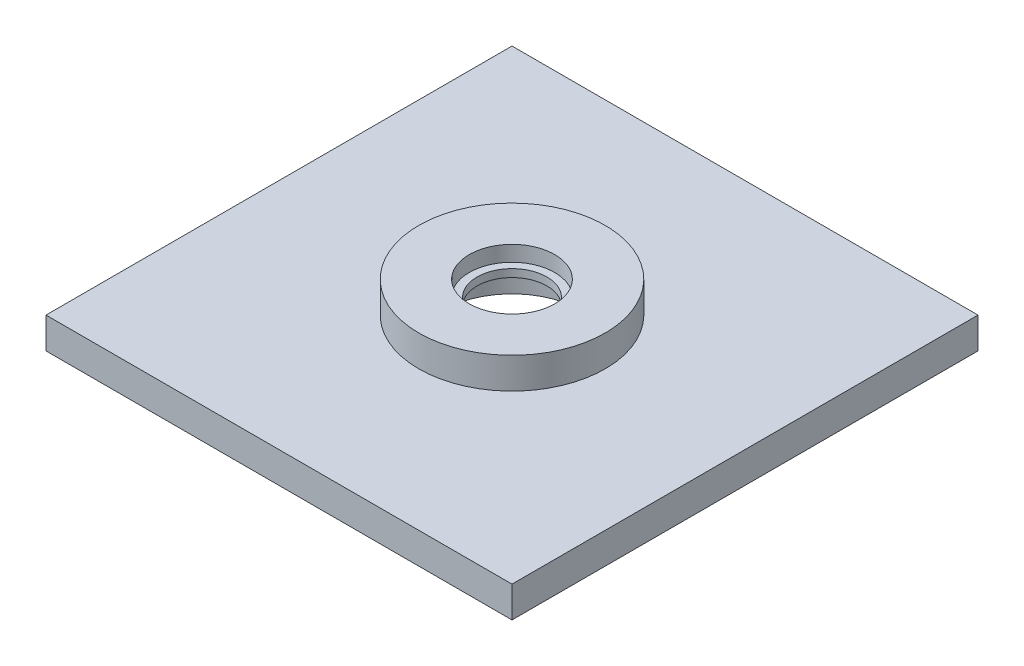
ISO-10303-21;
HEADER;
FILE_DESCRIPTION(('STEP AP214'),'2;1');
FILE_NAME('part.step','',(''),(''),'','','');
FILE_SCHEMA(('AUTOMOTIVE_DESIGN { 1 0 10303 214 1 1 1 1 }'));
ENDSEC;
DATA;
#1=APPLICATION_CONTEXT('core data for automotive mechanical design processes');
#2=APPLICATION_PROTOCOL_DEFINITION('international standard','automotive_design',2000,#1);
#3=PRODUCT_CONTEXT('',#1,'mechanical');
#4=PRODUCT('Part','Part','',(#3));
#5=PRODUCT_RELATED_PRODUCT_CATEGORY('part','',(#4));
#6=PRODUCT_DEFINITION_FORMATION('','',#4);
#7=PRODUCT_DEFINITION_CONTEXT('part definition',#1,'design');
#8=PRODUCT_DEFINITION('design','',#6,#7);
#9=PRODUCT_DEFINITION_SHAPE('','',#8);
#10=(LENGTH_UNIT() NAMED_UNIT(*) SI_UNIT(.MILLI.,.METRE.));
#11=(NAMED_UNIT(*) PLANE_ANGLE_UNIT() SI_UNIT($,.RADIAN.));
#12=(NAMED_UNIT(*) SI_UNIT($,.STERADIAN.) SOLID_ANGLE_UNIT());
#13=UNCERTAINTY_MEASURE_WITH_UNIT(LENGTH_MEASURE(1.E-05),#10,'distance_accuracy_value','');
#14=(GEOMETRIC_REPRESENTATION_CONTEXT(3) GLOBAL_UNCERTAINTY_ASSIGNED_CONTEXT((#13)) GLOBAL_UNIT_ASSIGNED_CONTEXT((#10,
#11,#12)) REPRESENTATION_CONTEXT('',''));
#15=CARTESIAN_POINT('',(0.,0.,0.));
#16=DIRECTION('',(0.,0.,1.));
#17=DIRECTION('',(1.,0.,0.));
#18=AXIS2_PLACEMENT_3D('',#15,#16,#17);
#19=CARTESIAN_POINT('',(0.,6.35,0.));
#20=DIRECTION('',(0.,-1.,0.));
#21=DIRECTION('',(0.,0.,-1.));
#22=AXIS2_PLACEMENT_3D('',#19,#20,#21);
#23=CYLINDRICAL_SURFACE('',#22,7.14375);
#24=CARTESIAN_POINT('',(0.,7.9375,0.));
#25=DIRECTION('',(0.,-1.,0.));
#26=DIRECTION('',(0.,0.,-1.));
#27=AXIS2_PLACEMENT_3D('',#24,#25,#26);
#28=CIRCLE('',#27,7.14375);
#29=CARTESIAN_POINT('',(0.,7.9375,-7.14375000000001));
#30=VERTEX_POINT('',#29);
#31=EDGE_CURVE('E109',#30,#30,#28,.T.);
#32=ORIENTED_EDGE('',*,*,#31,.T.);
#33=EDGE_LOOP('',(#32));
#34=FACE_BOUND('',#33,.T.);
#35=CARTESIAN_POINT('',(0.,9.525,0.));
#36=DIRECTION('',(0.,1.,0.));
#37=DIRECTION('',(0.,0.,1.));
#38=AXIS2_PLACEMENT_3D('',#35,#36,#37);
#39=CIRCLE('',#38,7.14375);
#40=CARTESIAN_POINT('',(0.,9.525,7.14374999999999));
#41=VERTEX_POINT('',#40);
#42=EDGE_CURVE('E37',#41,#41,#39,.T.);
#43=ORIENTED_EDGE('',*,*,#42,.T.);
#44=EDGE_LOOP('',(#43));
#45=FACE_BOUND('',#44,.T.);
#46=ADVANCED_FACE('F33',(#34,#45),#23,.F.);
#47=CARTESIAN_POINT('',(0.,6.35,0.));
#48=DIRECTION('',(0.,1.,0.));
#49=DIRECTION('',(0.,0.,1.));
#50=AXIS2_PLACEMENT_3D('',#47,#48,#49);
#51=PLANE('',#50);
#52=DIRECTION('',(0.,0.,-1.));
#53=VECTOR('',#52,1.);
#54=CARTESIAN_POINT('',(47.625,6.35,-47.625));
#55=LINE('',#54,#53);
#56=CARTESIAN_POINT('',(47.625,6.35,47.625));
#57=VERTEX_POINT('',#56);
#58=CARTESIAN_POINT('',(47.625,6.35,-47.625));
#59=VERTEX_POINT('',#58);
#60=EDGE_CURVE('E88',#57,#59,#55,.T.);
#61=ORIENTED_EDGE('',*,*,#60,.T.);
#62=DIRECTION('',(-1.,0.,0.));
#63=VECTOR('',#62,1.);
#64=CARTESIAN_POINT('',(-47.625,6.35,-47.625));
#65=LINE('',#64,#63);
#66=CARTESIAN_POINT('',(-47.625,6.35,-47.625));
#67=VERTEX_POINT('',#66);
#68=EDGE_CURVE('E82',#59,#67,#65,.T.);
#69=ORIENTED_EDGE('',*,*,#68,.T.);
#70=DIRECTION('',(0.,0.,1.));
#71=VECTOR('',#70,1.);
#72=CARTESIAN_POINT('',(-47.625,6.35,-47.625));
#73=LINE('',#72,#71);
#74=CARTESIAN_POINT('',(-47.625,6.35,47.625));
#75=VERTEX_POINT('',#74);
#76=EDGE_CURVE('E86',#67,#75,#73,.T.);
#77=ORIENTED_EDGE('',*,*,#76,.T.);
#78=DIRECTION('',(1.,0.,0.));
#79=VECTOR('',#78,1.);
#80=CARTESIAN_POINT('',(-47.625,6.35,47.625));
#81=LINE('',#80,#79);
#82=EDGE_CURVE('E52',#75,#57,#81,.T.);
#83=ORIENTED_EDGE('',*,*,#82,.T.);
#84=EDGE_LOOP('',(#61,#69,#77,#83));
#85=FACE_BOUND('',#84,.T.);
#86=CARTESIAN_POINT('',(0.,6.35,0.));
#87=DIRECTION('',(0.,1.,0.));
#88=DIRECTION('',(0.,0.,1.));
#89=AXIS2_PLACEMENT_3D('',#86,#87,#88);
#90=CIRCLE('',#89,19.05);
#91=CARTESIAN_POINT('',(0.,6.35,19.05));
#92=VERTEX_POINT('',#91);
#93=EDGE_CURVE('E111',#92,#92,#90,.T.);
#94=ORIENTED_EDGE('',*,*,#93,.F.);
#95=EDGE_LOOP('',(#94));
#96=FACE_BOUND('',#95,.T.);
#97=ADVANCED_FACE('F83',(#85,#96),#51,.T.);
#98=CARTESIAN_POINT('',(0.,0.,0.));
#99=DIRECTION('',(0.,1.,0.));
#100=DIRECTION('',(0.,0.,1.));
#101=AXIS2_PLACEMENT_3D('',#98,#99,#100);
#102=PLANE('',#101);
#103=CARTESIAN_POINT('',(0.,0.,0.));
#104=DIRECTION('',(0.,-1.,0.));
#105=DIRECTION('',(0.,0.,-1.));
#106=AXIS2_PLACEMENT_3D('',#103,#104,#105);
#107=CIRCLE('',#106,14.2875);
#108=CARTESIAN_POINT('',(0.,0.,-14.2875));
#109=VERTEX_POINT('',#108);
#110=EDGE_CURVE('E118',#109,#109,#107,.T.);
#111=ORIENTED_EDGE('',*,*,#110,.F.);
#112=EDGE_LOOP('',(#111));
#113=FACE_BOUND('',#112,.T.);
#114=DIRECTION('',(0.,0.,-1.));
#115=VECTOR('',#114,1.);
#116=CARTESIAN_POINT('',(47.625,0.,-47.625));
#117=LINE('',#116,#115);
#118=CARTESIAN_POINT('',(47.625,0.,47.625));
#119=VERTEX_POINT('',#118);
#120=CARTESIAN_POINT('',(47.625,0.,-47.625));
#121=VERTEX_POINT('',#120);
#122=EDGE_CURVE('E101',#119,#121,#117,.T.);
#123=ORIENTED_EDGE('',*,*,#122,.F.);
#124=DIRECTION('',(1.,0.,0.));
#125=VECTOR('',#124,1.);
#126=CARTESIAN_POINT('',(-47.625,0.,47.625));
#127=LINE('',#126,#125);
#128=CARTESIAN_POINT('',(-47.625,0.,47.625));
#129=VERTEX_POINT('',#128);
#130=EDGE_CURVE('E75',#129,#119,#127,.T.);
#131=ORIENTED_EDGE('',*,*,#130,.F.);
#132=DIRECTION('',(0.,0.,1.));
#133=VECTOR('',#132,1.);
#134=CARTESIAN_POINT('',(-47.625,0.,-47.625));
#135=LINE('',#134,#133);
#136=CARTESIAN_POINT('',(-47.625,0.,-47.625));
#137=VERTEX_POINT('',#136);
#138=EDGE_CURVE('E69',#137,#129,#135,.T.);
#139=ORIENTED_EDGE('',*,*,#138,.F.);
#140=DIRECTION('',(-1.,0.,0.));
#141=VECTOR('',#140,1.);
#142=CARTESIAN_POINT('',(-47.625,0.,-47.625));
#143=LINE('',#142,#141);
#144=EDGE_CURVE('E92',#121,#137,#143,.T.);
#145=ORIENTED_EDGE('',*,*,#144,.F.);
#146=EDGE_LOOP('',(#123,#131,#139,#145));
#147=FACE_BOUND('',#146,.T.);
#148=ADVANCED_FACE('F140',(#113,#147),#102,.F.);
#149=CARTESIAN_POINT('',(47.625,6.35,-47.625));
#150=DIRECTION('',(-1.,0.,0.));
#151=DIRECTION('',(0.,0.,1.));
#152=AXIS2_PLACEMENT_3D('',#149,#150,#151);
#153=PLANE('',#152);
#154=ORIENTED_EDGE('',*,*,#122,.T.);
#155=DIRECTION('',(0.,-1.,0.));
#156=VECTOR('',#155,1.);
#157=CARTESIAN_POINT('',(47.625,6.35,-47.625));
#158=LINE('',#157,#156);
#159=EDGE_CURVE('E11',#59,#121,#158,.T.);
#160=ORIENTED_EDGE('',*,*,#159,.F.);
#161=ORIENTED_EDGE('',*,*,#60,.F.);
#162=DIRECTION('',(0.,-1.,0.));
#163=VECTOR('',#162,1.);
#164=CARTESIAN_POINT('',(47.625,6.35,47.625));
#165=LINE('',#164,#163);
#166=EDGE_CURVE('E97',#57,#119,#165,.T.);
#167=ORIENTED_EDGE('',*,*,#166,.T.);
#168=EDGE_LOOP('',(#154,#160,#161,#167));
#169=FACE_BOUND('',#168,.T.);
#170=ADVANCED_FACE('F35',(#169),#153,.F.);
#171=CARTESIAN_POINT('',(-47.625,6.35,-47.625));
#172=DIRECTION('',(0.,0.,1.));
#173=DIRECTION('',(1.,0.,0.));
#174=AXIS2_PLACEMENT_3D('',#171,#172,#173);
#175=PLANE('',#174);
#176=ORIENTED_EDGE('',*,*,#144,.T.);
#177=DIRECTION('',(0.,-1.,0.));
#178=VECTOR('',#177,1.);
#179=CARTESIAN_POINT('',(-47.625,6.35,-47.625));
#180=LINE('',#179,#178);
#181=EDGE_CURVE('E43',#67,#137,#180,.T.);
#182=ORIENTED_EDGE('',*,*,#181,.F.);
#183=ORIENTED_EDGE('',*,*,#68,.F.);
#184=ORIENTED_EDGE('',*,*,#159,.T.);
#185=EDGE_LOOP('',(#176,#182,#183,#184));
#186=FACE_BOUND('',#185,.T.);
#187=ADVANCED_FACE('F91',(#186),#175,.F.);
#188=CARTESIAN_POINT('',(-47.625,6.35,-47.625));
#189=DIRECTION('',(1.,0.,0.));
#190=DIRECTION('',(0.,0.,-1.));
#191=AXIS2_PLACEMENT_3D('',#188,#189,#190);
#192=PLANE('',#191);
#193=ORIENTED_EDGE('',*,*,#138,.T.);
#194=DIRECTION('',(0.,-1.,0.));
#195=VECTOR('',#194,1.);
#196=CARTESIAN_POINT('',(-47.625,6.35,47.625));
#197=LINE('',#196,#195);
#198=EDGE_CURVE('E93',#75,#129,#197,.T.);
#199=ORIENTED_EDGE('',*,*,#198,.F.);
#200=ORIENTED_EDGE('',*,*,#76,.F.);
#201=ORIENTED_EDGE('',*,*,#181,.T.);
#202=EDGE_LOOP('',(#193,#199,#200,#201));
#203=FACE_BOUND('',#202,.T.);
#204=ADVANCED_FACE('F95',(#203),#192,.F.);
#205=CARTESIAN_POINT('',(-47.625,6.35,47.625));
#206=DIRECTION('',(0.,0.,-1.));
#207=DIRECTION('',(-1.,0.,0.));
#208=AXIS2_PLACEMENT_3D('',#205,#206,#207);
#209=PLANE('',#208);
#210=ORIENTED_EDGE('',*,*,#130,.T.);
#211=ORIENTED_EDGE('',*,*,#166,.F.);
#212=ORIENTED_EDGE('',*,*,#82,.F.);
#213=ORIENTED_EDGE('',*,*,#198,.T.);
#214=EDGE_LOOP('',(#210,#211,#212,#213));
#215=FACE_BOUND('',#214,.T.);
#216=ADVANCED_FACE('F150',(#215),#209,.F.);
#217=CARTESIAN_POINT('',(0.,12.7,0.));
#218=DIRECTION('',(0.,1.,0.));
#219=DIRECTION('',(0.,0.,1.));
#220=AXIS2_PLACEMENT_3D('',#217,#218,#219);
#221=PLANE('',#220);
#222=CARTESIAN_POINT('',(0.,12.7,0.));
#223=DIRECTION('',(0.,1.,0.));
#224=DIRECTION('',(0.,0.,1.));
#225=AXIS2_PLACEMENT_3D('',#222,#223,#224);
#226=CIRCLE('',#225,8.73125);
#227=CARTESIAN_POINT('',(0.,12.7,8.73124999999999));
#228=VERTEX_POINT('',#227);
#229=EDGE_CURVE('E125',#228,#228,#226,.T.);
#230=ORIENTED_EDGE('',*,*,#229,.F.);
#231=EDGE_LOOP('',(#230));
#232=FACE_BOUND('',#231,.T.);
#233=CARTESIAN_POINT('',(0.,12.7,0.));
#234=DIRECTION('',(0.,1.,0.));
#235=DIRECTION('',(0.,0.,1.));
#236=AXIS2_PLACEMENT_3D('',#233,#234,#235);
#237=CIRCLE('',#236,19.05);
#238=CARTESIAN_POINT('',(0.,12.7,19.05));
#239=VERTEX_POINT('',#238);
#240=EDGE_CURVE('E104',#239,#239,#237,.T.);
#241=ORIENTED_EDGE('',*,*,#240,.T.);
#242=EDGE_LOOP('',(#241));
#243=FACE_BOUND('',#242,.T.);
#244=ADVANCED_FACE('F131',(#232,#243),#221,.T.);
#245=CARTESIAN_POINT('',(0.,12.7,0.));
#246=DIRECTION('',(0.,-1.,0.));
#247=DIRECTION('',(0.,0.,-1.));
#248=AXIS2_PLACEMENT_3D('',#245,#246,#247);
#249=CYLINDRICAL_SURFACE('',#248,19.05);
#250=ORIENTED_EDGE('',*,*,#240,.F.);
#251=EDGE_LOOP('',(#250));
#252=FACE_BOUND('',#251,.T.);
#253=ORIENTED_EDGE('',*,*,#93,.T.);
#254=EDGE_LOOP('',(#253));
#255=FACE_BOUND('',#254,.T.);
#256=ADVANCED_FACE('F133',(#252,#255),#249,.T.);
#257=CARTESIAN_POINT('',(0.,7.9375,0.));
#258=DIRECTION('',(0.,-1.,0.));
#259=DIRECTION('',(0.,0.,-1.));
#260=AXIS2_PLACEMENT_3D('',#257,#258,#259);
#261=CYLINDRICAL_SURFACE('',#260,14.2875);
#262=CARTESIAN_POINT('',(0.,7.9375,0.));
#263=DIRECTION('',(0.,-1.,0.));
#264=DIRECTION('',(0.,0.,-1.));
#265=AXIS2_PLACEMENT_3D('',#262,#263,#264);
#266=CIRCLE('',#265,14.2875);
#267=CARTESIAN_POINT('',(0.,7.9375,-14.2875));
#268=VERTEX_POINT('',#267);
#269=EDGE_CURVE('E112',#268,#268,#266,.T.);
#270=ORIENTED_EDGE('',*,*,#269,.F.);
#271=EDGE_LOOP('',(#270));
#272=FACE_BOUND('',#271,.T.);
#273=ORIENTED_EDGE('',*,*,#110,.T.);
#274=EDGE_LOOP('',(#273));
#275=FACE_BOUND('',#274,.T.);
#276=ADVANCED_FACE('F136',(#272,#275),#261,.F.);
#277=CARTESIAN_POINT('',(0.,7.9375,0.));
#278=DIRECTION('',(0.,-1.,0.));
#279=DIRECTION('',(0.,0.,-1.));
#280=AXIS2_PLACEMENT_3D('',#277,#278,#279);
#281=PLANE('',#280);
#282=ORIENTED_EDGE('',*,*,#31,.F.);
#283=EDGE_LOOP('',(#282));
#284=FACE_BOUND('',#283,.T.);
#285=ORIENTED_EDGE('',*,*,#269,.T.);
#286=EDGE_LOOP('',(#285));
#287=FACE_BOUND('',#286,.T.);
#288=ADVANCED_FACE('F179',(#284,#287),#281,.T.);
#289=CARTESIAN_POINT('',(0.,9.525,0.));
#290=DIRECTION('',(0.,1.,0.));
#291=DIRECTION('',(0.,0.,1.));
#292=AXIS2_PLACEMENT_3D('',#289,#290,#291);
#293=CYLINDRICAL_SURFACE('',#292,8.73125);
#294=CARTESIAN_POINT('',(0.,9.525,0.));
#295=DIRECTION('',(0.,1.,0.));
#296=DIRECTION('',(0.,0.,1.));
#297=AXIS2_PLACEMENT_3D('',#294,#295,#296);
#298=CIRCLE('',#297,8.73125);
#299=CARTESIAN_POINT('',(0.,9.525,8.73124999999999));
#300=VERTEX_POINT('',#299);
#301=EDGE_CURVE('E235',#300,#300,#298,.T.);
#302=ORIENTED_EDGE('',*,*,#301,.F.);
#303=EDGE_LOOP('',(#302));
#304=FACE_BOUND('',#303,.T.);
#305=ORIENTED_EDGE('',*,*,#229,.T.);
#306=EDGE_LOOP('',(#305));
#307=FACE_BOUND('',#306,.T.);
#308=ADVANCED_FACE('F189',(#304,#307),#293,.F.);
#309=CARTESIAN_POINT('',(0.,9.525,0.));
#310=DIRECTION('',(0.,1.,0.));
#311=DIRECTION('',(0.,0.,1.));
#312=AXIS2_PLACEMENT_3D('',#309,#310,#311);
#313=PLANE('',#312);
#314=ORIENTED_EDGE('',*,*,#42,.F.);
#315=EDGE_LOOP('',(#314));
#316=FACE_BOUND('',#315,.T.);
#317=ORIENTED_EDGE('',*,*,#301,.T.);
#318=EDGE_LOOP('',(#317));
#319=FACE_BOUND('',#318,.T.);
#320=ADVANCED_FACE('F216',(#316,#319),#313,.T.);
#321=CLOSED_SHELL('',(#46,#97,#148,#170,#187,#204,#216,#244,#256,#276,#288,#308,#320));
#322=MANIFOLD_SOLID_BREP('B2',#321);
#323=ADVANCED_BREP_SHAPE_REPRESENTATION('',(#18,#322),#14);
#324=SHAPE_DEFINITION_REPRESENTATION(#9,#323);
ENDSEC;
END-ISO-10303-21;
